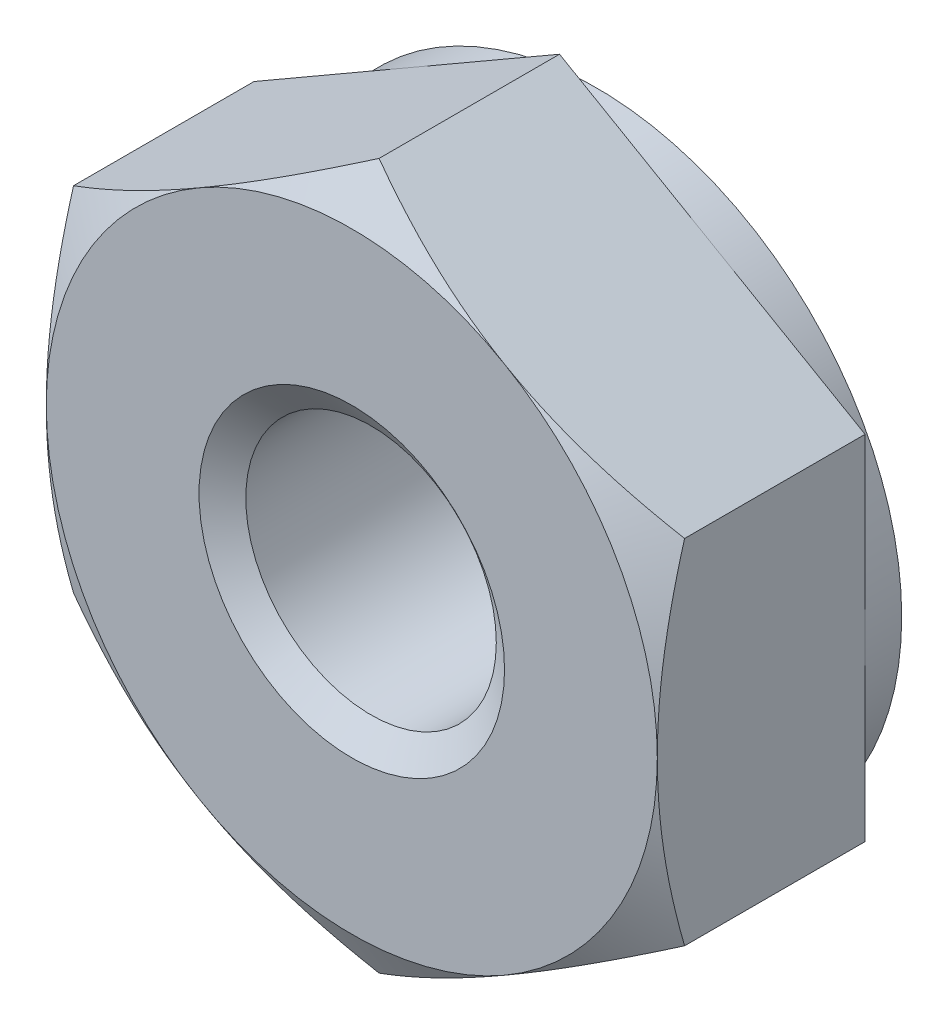
ISO-10303-21;
HEADER;
FILE_DESCRIPTION(('STEP AP214'),'2;1');
FILE_NAME('part.step','',(''),(''),'','','');
FILE_SCHEMA(('AUTOMOTIVE_DESIGN { 1 0 10303 214 1 1 1 1 }'));
ENDSEC;
DATA;
#1=APPLICATION_CONTEXT('core data for automotive mechanical design processes');
#2=APPLICATION_PROTOCOL_DEFINITION('international standard','automotive_design',2000,#1);
#3=PRODUCT_CONTEXT('',#1,'mechanical');
#4=PRODUCT('Part','Part','',(#3));
#5=PRODUCT_RELATED_PRODUCT_CATEGORY('part','',(#4));
#6=PRODUCT_DEFINITION_FORMATION('','',#4);
#7=PRODUCT_DEFINITION_CONTEXT('part definition',#1,'design');
#8=PRODUCT_DEFINITION('design','',#6,#7);
#9=PRODUCT_DEFINITION_SHAPE('','',#8);
#10=(LENGTH_UNIT() NAMED_UNIT(*) SI_UNIT(.MILLI.,.METRE.));
#11=(NAMED_UNIT(*) PLANE_ANGLE_UNIT() SI_UNIT($,.RADIAN.));
#12=(NAMED_UNIT(*) SI_UNIT($,.STERADIAN.) SOLID_ANGLE_UNIT());
#13=UNCERTAINTY_MEASURE_WITH_UNIT(LENGTH_MEASURE(1.E-05),#10,'distance_accuracy_value','');
#14=(GEOMETRIC_REPRESENTATION_CONTEXT(3) GLOBAL_UNCERTAINTY_ASSIGNED_CONTEXT((#13)) GLOBAL_UNIT_ASSIGNED_CONTEXT((#10,
#11,#12)) REPRESENTATION_CONTEXT('',''));
#15=CARTESIAN_POINT('',(0.,0.,0.));
#16=DIRECTION('',(0.,0.,1.));
#17=DIRECTION('',(1.,0.,0.));
#18=AXIS2_PLACEMENT_3D('',#15,#16,#17);
#19=CARTESIAN_POINT('',(0.,0.,-2.));
#20=DIRECTION('',(0.,0.,1.));
#21=DIRECTION('',(1.,0.,0.));
#22=AXIS2_PLACEMENT_3D('',#19,#20,#21);
#23=CYLINDRICAL_SURFACE('',#22,1.025);
#24=CARTESIAN_POINT('',(0.,0.,-0.157546696097185));
#25=DIRECTION('',(0.,0.,1.));
#26=DIRECTION('',(1.,0.,0.));
#27=AXIS2_PLACEMENT_3D('',#24,#25,#26);
#28=CIRCLE('',#27,1.025);
#29=CARTESIAN_POINT('',(1.025,0.,-0.157546696097185));
#30=VERTEX_POINT('',#29);
#31=EDGE_CURVE('E154',#30,#30,#28,.F.);
#32=ORIENTED_EDGE('',*,*,#31,.F.);
#33=EDGE_LOOP('',(#32));
#34=FACE_BOUND('',#33,.T.);
#35=CARTESIAN_POINT('',(0.,0.,-1.81705330390282));
#36=DIRECTION('',(0.,0.,-1.));
#37=DIRECTION('',(-1.,0.,0.));
#38=AXIS2_PLACEMENT_3D('',#35,#36,#37);
#39=CIRCLE('',#38,1.025);
#40=CARTESIAN_POINT('',(-1.025,0.,-1.81705330390282));
#41=VERTEX_POINT('',#40);
#42=EDGE_CURVE('E42',#41,#41,#39,.F.);
#43=ORIENTED_EDGE('',*,*,#42,.F.);
#44=EDGE_LOOP('',(#43));
#45=FACE_BOUND('',#44,.T.);
#46=ADVANCED_FACE('F37',(#34,#45),#23,.F.);
#47=CARTESIAN_POINT('',(0.,2.88675134594813,-2.));
#48=DIRECTION('',(0.,0.,-1.));
#49=DIRECTION('',(-1.,0.,0.));
#50=AXIS2_PLACEMENT_3D('',#47,#48,#49);
#51=PLANE('',#50);
#52=CARTESIAN_POINT('',(0.,0.,-2.));
#53=DIRECTION('',(0.,0.,-1.));
#54=DIRECTION('',(-1.,0.,0.));
#55=AXIS2_PLACEMENT_3D('',#52,#53,#54);
#56=CIRCLE('',#55,2.5);
#57=CARTESIAN_POINT('',(-2.5,0.,-2.));
#58=VERTEX_POINT('',#57);
#59=EDGE_CURVE('E281',#58,#58,#56,.F.);
#60=ORIENTED_EDGE('',*,*,#59,.F.);
#61=EDGE_LOOP('',(#60));
#62=FACE_BOUND('',#61,.T.);
#63=CARTESIAN_POINT('',(0.,0.,-2.));
#64=DIRECTION('',(0.,0.,-1.));
#65=DIRECTION('',(-1.,0.,0.));
#66=AXIS2_PLACEMENT_3D('',#63,#64,#65);
#67=CIRCLE('',#66,1.25);
#68=CARTESIAN_POINT('',(-1.25,0.,-2.));
#69=VERTEX_POINT('',#68);
#70=EDGE_CURVE('E301',#69,#69,#67,.F.);
#71=ORIENTED_EDGE('',*,*,#70,.T.);
#72=EDGE_LOOP('',(#71));
#73=FACE_BOUND('',#72,.T.);
#74=ADVANCED_FACE('F233',(#62,#73),#51,.T.);
#75=CARTESIAN_POINT('',(0.,2.88675134594813,0.));
#76=DIRECTION('',(0.,0.,-1.));
#77=DIRECTION('',(-1.,0.,0.));
#78=AXIS2_PLACEMENT_3D('',#75,#76,#77);
#79=PLANE('',#78);
#80=CARTESIAN_POINT('',(0.,0.,0.));
#81=DIRECTION('',(0.,0.,-1.));
#82=DIRECTION('',(-1.,0.,0.));
#83=AXIS2_PLACEMENT_3D('',#80,#81,#82);
#84=CIRCLE('',#83,2.5);
#85=CARTESIAN_POINT('',(-1.25,2.1650635094611,0.));
#86=VERTEX_POINT('',#85);
#87=CARTESIAN_POINT('',(-2.5,0.,0.));
#88=VERTEX_POINT('',#87);
#89=EDGE_CURVE('E49',#86,#88,#84,.F.);
#90=ORIENTED_EDGE('',*,*,#89,.T.);
#91=CARTESIAN_POINT('',(-1.25,-2.1650635094611,0.));
#92=VERTEX_POINT('',#91);
#93=EDGE_CURVE('E12',#88,#92,#84,.F.);
#94=ORIENTED_EDGE('',*,*,#93,.T.);
#95=CARTESIAN_POINT('',(1.25,-2.1650635094611,0.));
#96=VERTEX_POINT('',#95);
#97=EDGE_CURVE('E47',#92,#96,#84,.F.);
#98=ORIENTED_EDGE('',*,*,#97,.T.);
#99=CARTESIAN_POINT('',(2.5,0.,0.));
#100=VERTEX_POINT('',#99);
#101=EDGE_CURVE('E133',#96,#100,#84,.F.);
#102=ORIENTED_EDGE('',*,*,#101,.T.);
#103=CARTESIAN_POINT('',(0.,0.,0.));
#104=DIRECTION('',(0.,0.,1.));
#105=DIRECTION('',(1.,0.,0.));
#106=AXIS2_PLACEMENT_3D('',#103,#104,#105);
#107=CIRCLE('',#106,2.5);
#108=CARTESIAN_POINT('',(1.25,2.1650635094611,0.));
#109=VERTEX_POINT('',#108);
#110=EDGE_CURVE('E145',#100,#109,#107,.T.);
#111=ORIENTED_EDGE('',*,*,#110,.T.);
#112=EDGE_CURVE('E160',#109,#86,#84,.F.);
#113=ORIENTED_EDGE('',*,*,#112,.T.);
#114=EDGE_LOOP('',(#90,#94,#98,#102,#111,#113));
#115=FACE_BOUND('',#114,.T.);
#116=CARTESIAN_POINT('',(0.,0.,0.));
#117=DIRECTION('',(0.,0.,1.));
#118=DIRECTION('',(1.,0.,0.));
#119=AXIS2_PLACEMENT_3D('',#116,#117,#118);
#120=CIRCLE('',#119,1.25);
#121=CARTESIAN_POINT('',(1.25,0.,0.));
#122=VERTEX_POINT('',#121);
#123=EDGE_CURVE('E300',#122,#122,#120,.T.);
#124=ORIENTED_EDGE('',*,*,#123,.F.);
#125=EDGE_LOOP('',(#124));
#126=FACE_BOUND('',#125,.T.);
#127=ADVANCED_FACE('F157',(#115,#126),#79,.F.);
#128=CARTESIAN_POINT('',(0.,2.88675134594813,-2.));
#129=DIRECTION('',(-0.5,0.866025403784438,0.));
#130=DIRECTION('',(-0.866025403784438,-0.5,0.));
#131=AXIS2_PLACEMENT_3D('',#128,#129,#130);
#132=PLANE('',#131);
#133=DIRECTION('',(0.,0.,1.));
#134=VECTOR('',#133,1.);
#135=CARTESIAN_POINT('',(-2.5,1.44337567297406,-2.));
#136=LINE('',#135,#134);
#137=CARTESIAN_POINT('',(-2.5,1.44337567297406,-1.7));
#138=VERTEX_POINT('',#137);
#139=CARTESIAN_POINT('',(-2.5,1.44337567297406,-0.223290993692604));
#140=VERTEX_POINT('',#139);
#141=EDGE_CURVE('E290',#138,#140,#136,.T.);
#142=ORIENTED_EDGE('',*,*,#141,.T.);
#143=CARTESIAN_POINT('',(-2.5002,1.44326020292023,-0.223357664359109));
#144=CARTESIAN_POINT('',(-2.39033676526513,1.50668977106845,-0.186721620107627));
#145=CARTESIAN_POINT('',(-2.27952520010347,1.57066685804385,-0.153402218965057));
#146=CARTESIAN_POINT('',(-2.05598316653395,1.69972891130041,-0.0952422855578582));
#147=CARTESIAN_POINT('',(-1.94324872547161,1.7648161711947,-0.0704223291477385));
#148=CARTESIAN_POINT('',(-1.71917700612473,1.8941840386774,-0.031785651441052));
#149=CARTESIAN_POINT('',(-1.60787420823262,1.95844473900197,-0.0177117961856388));
#150=CARTESIAN_POINT('',(-1.38474477253167,2.08726857876804,-0.000909152352750061));
#151=CARTESIAN_POINT('',(-1.27291894598577,2.15183124982667,0.00183354879637354));
#152=CARTESIAN_POINT('',(-1.06395802444848,2.27247489412634,-0.00386576000805347));
#153=CARTESIAN_POINT('',(-0.966791682442268,2.32857390783979,-0.0109083943818617));
#154=CARTESIAN_POINT('',(-0.773092050288997,2.44040644260542,-0.0332314191249428));
#155=CARTESIAN_POINT('',(-0.676559430340267,2.4961395767184,-0.0485194384402676));
#156=CARTESIAN_POINT('',(-0.482460278259523,2.60820277442169,-0.0867390938444211));
#157=CARTESIAN_POINT('',(-0.384918318217859,2.66451865130903,-0.109832776125518));
#158=CARTESIAN_POINT('',(-0.191289391923914,2.77631036402774,-0.162246656577914));
#159=CARTESIAN_POINT('',(-0.0951999441138235,2.83178763258718,-0.19155453562455));
#160=CARTESIAN_POINT('',(0.000200000000000565,2.88686681600197,-0.22335766435911));
#161=B_SPLINE_CURVE_WITH_KNOTS('',3,(#143,#144,#145,#146,#147,#148,#149,#150,#151,#152,#153,
#154,#155,#156,#157,#158,#159,#160),.UNSPECIFIED.,.F.,.F.,(4,2,2,2,2,2,2,2,4),(0.,
0.396285827362227,0.793524330152052,1.18093086852114,1.56786160134475,1.90479741793733,
2.24204551660463,2.58677531536756,2.93082800105257),.UNSPECIFIED.);
#162=EDGE_CURVE('E61',#140,#86,#161,.T.);
#163=ORIENTED_EDGE('',*,*,#162,.T.);
#164=CARTESIAN_POINT('',(0.,2.88675134594813,-0.223290993692604));
#165=VERTEX_POINT('',#164);
#166=EDGE_CURVE('E169',#86,#165,#161,.T.);
#167=ORIENTED_EDGE('',*,*,#166,.T.);
#168=DIRECTION('',(0.,0.,1.));
#169=VECTOR('',#168,1.);
#170=CARTESIAN_POINT('',(0.,2.88675134594813,-2.));
#171=LINE('',#170,#169);
#172=CARTESIAN_POINT('',(0.,2.88675134594813,-1.7));
#173=VERTEX_POINT('',#172);
#174=EDGE_CURVE('E278',#173,#165,#171,.T.);
#175=ORIENTED_EDGE('',*,*,#174,.F.);
#176=DIRECTION('',(-0.866025403784438,-0.5,0.));
#177=VECTOR('',#176,1.);
#178=CARTESIAN_POINT('',(0.,2.88675134594813,-1.7));
#179=LINE('',#178,#177);
#180=CARTESIAN_POINT('',(-1.25,2.1650635094611,-1.7));
#181=VERTEX_POINT('',#180);
#182=EDGE_CURVE('E266',#173,#181,#179,.T.);
#183=ORIENTED_EDGE('',*,*,#182,.T.);
#184=EDGE_CURVE('E262',#181,#138,#179,.T.);
#185=ORIENTED_EDGE('',*,*,#184,.T.);
#186=EDGE_LOOP('',(#142,#163,#167,#175,#183,#185));
#187=FACE_BOUND('',#186,.T.);
#188=ADVANCED_FACE('F39',(#187),#132,.T.);
#189=CARTESIAN_POINT('',(2.5,1.44337567297406,-2.));
#190=DIRECTION('',(0.500000000000001,0.866025403784438,0.));
#191=DIRECTION('',(-0.866025403784438,0.500000000000001,0.));
#192=AXIS2_PLACEMENT_3D('',#189,#190,#191);
#193=PLANE('',#192);
#194=ORIENTED_EDGE('',*,*,#174,.T.);
#195=CARTESIAN_POINT('',(-0.000199999999999567,2.88686681600197,-0.22335766435911));
#196=CARTESIAN_POINT('',(0.109663234734872,2.82343724785375,-0.186721620107627));
#197=CARTESIAN_POINT('',(0.220474799896526,2.75946016087834,-0.153402218965057));
#198=CARTESIAN_POINT('',(0.44401683346605,2.63039810762178,-0.0952422855578585));
#199=CARTESIAN_POINT('',(0.556751274528389,2.5653108477275,-0.0704223291477389));
#200=CARTESIAN_POINT('',(0.78082299387527,2.43594298024479,-0.0317856514410521));
#201=CARTESIAN_POINT('',(0.892125791767378,2.37168227992023,-0.0177117961856388));
#202=CARTESIAN_POINT('',(1.11525522746834,2.24285844015415,-0.000909152352749881));
#203=CARTESIAN_POINT('',(1.22708105401423,2.17829576909552,0.00183354879637364));
#204=CARTESIAN_POINT('',(1.43604197555152,2.05765212479586,-0.00386576000805331));
#205=CARTESIAN_POINT('',(1.53320831755773,2.0015531110824,-0.0109083943818614));
#206=CARTESIAN_POINT('',(1.726907949711,1.88972057631678,-0.0332314191249423));
#207=CARTESIAN_POINT('',(1.82344056965973,1.8339874422038,-0.0485194384402671));
#208=CARTESIAN_POINT('',(2.01753972174048,1.7219242445005,-0.0867390938444206));
#209=CARTESIAN_POINT('',(2.11508168178214,1.66560836761316,-0.109832776125517));
#210=CARTESIAN_POINT('',(2.30871060807609,1.55381665489446,-0.162246656577914));
#211=CARTESIAN_POINT('',(2.40480005588618,1.49833938633502,-0.191554535624549));
#212=CARTESIAN_POINT('',(2.5002,1.44326020292023,-0.223357664359109));
#213=B_SPLINE_CURVE_WITH_KNOTS('',3,(#195,#196,#197,#198,#199,#200,#201,#202,#203,#204,#205,
#206,#207,#208,#209,#210,#211,#212),.UNSPECIFIED.,.F.,.F.,(4,2,2,2,2,2,2,2,4),(0.,
0.396285827362228,0.793524330152052,1.18093086852114,1.56786160134476,1.90479741793733,
2.24204551660463,2.58677531536756,2.93082800105257),.UNSPECIFIED.);
#214=EDGE_CURVE('E166',#165,#109,#213,.T.);
#215=ORIENTED_EDGE('',*,*,#214,.T.);
#216=CARTESIAN_POINT('',(2.5,1.44337567297407,-0.223290993692604));
#217=VERTEX_POINT('',#216);
#218=EDGE_CURVE('E148',#109,#217,#213,.T.);
#219=ORIENTED_EDGE('',*,*,#218,.T.);
#220=DIRECTION('',(0.,0.,1.));
#221=VECTOR('',#220,1.);
#222=CARTESIAN_POINT('',(2.5,1.44337567297406,-2.));
#223=LINE('',#222,#221);
#224=CARTESIAN_POINT('',(2.5,1.44337567297406,-1.7));
#225=VERTEX_POINT('',#224);
#226=EDGE_CURVE('E165',#225,#217,#223,.T.);
#227=ORIENTED_EDGE('',*,*,#226,.F.);
#228=DIRECTION('',(-0.866025403784438,0.500000000000001,0.));
#229=VECTOR('',#228,1.);
#230=CARTESIAN_POINT('',(2.5,1.44337567297406,-1.7));
#231=LINE('',#230,#229);
#232=CARTESIAN_POINT('',(1.25,2.1650635094611,-1.7));
#233=VERTEX_POINT('',#232);
#234=EDGE_CURVE('E274',#225,#233,#231,.T.);
#235=ORIENTED_EDGE('',*,*,#234,.T.);
#236=EDGE_CURVE('E270',#233,#173,#231,.T.);
#237=ORIENTED_EDGE('',*,*,#236,.T.);
#238=EDGE_LOOP('',(#194,#215,#219,#227,#235,#237));
#239=FACE_BOUND('',#238,.T.);
#240=ADVANCED_FACE('F246',(#239),#193,.T.);
#241=CARTESIAN_POINT('',(2.5,1.44337567297406,-2.));
#242=DIRECTION('',(-1.,0.,0.));
#243=DIRECTION('',(0.,0.,1.));
#244=AXIS2_PLACEMENT_3D('',#241,#242,#243);
#245=PLANE('',#244);
#246=CARTESIAN_POINT('',(2.5,-3.82804499372432,-1.1963167632754));
#247=CARTESIAN_POINT('',(2.5,-3.71828085649173,-1.14327266922931));
#248=CARTESIAN_POINT('',(2.5,-3.60825720059554,-1.09075587737963));
#249=CARTESIAN_POINT('',(2.5,-3.38755052986221,-0.987078216748228));
#250=CARTESIAN_POINT('',(2.5,-3.27686740487455,-0.935917582729521));
#251=CARTESIAN_POINT('',(2.5,-3.05410357303959,-0.834984039411599));
#252=CARTESIAN_POINT('',(2.5,-2.94201849305851,-0.7852207469144));
#253=CARTESIAN_POINT('',(2.5,-2.71692709217039,-0.687831615887687));
#254=CARTESIAN_POINT('',(2.5,-2.60392081964711,-0.640205665942513));
#255=CARTESIAN_POINT('',(2.5,-2.37540441715611,-0.547094156496477));
#256=CARTESIAN_POINT('',(2.5,-2.25988058014231,-0.501642052634904));
#257=CARTESIAN_POINT('',(2.5,-2.02747029246855,-0.414297644349638));
#258=CARTESIAN_POINT('',(2.5,-1.91058369184876,-0.372405735979065));
#259=CARTESIAN_POINT('',(2.5,-1.67550198908606,-0.293307342769301));
#260=CARTESIAN_POINT('',(2.5,-1.5573102732053,-0.256090896739898));
#261=CARTESIAN_POINT('',(2.5,-1.31924659147407,-0.187552097840316));
#262=CARTESIAN_POINT('',(2.5,-1.19937516991093,-0.15622788104797));
#263=CARTESIAN_POINT('',(2.5,-0.957870204363749,-0.100994246846276));
#264=CARTESIAN_POINT('',(2.5,-0.836236200197809,-0.0770868037228373));
#265=CARTESIAN_POINT('',(2.5,-0.591501703670345,-0.0382963974514643));
#266=CARTESIAN_POINT('',(2.5,-0.468401210012358,-0.0234134422823115));
#267=CARTESIAN_POINT('',(2.5,-0.222157493517463,-0.00398863321839737));
#268=CARTESIAN_POINT('',(2.5,-0.0990195694337562,0.000618687975651133));
#269=CARTESIAN_POINT('',(2.5,0.147170053504669,-0.000752541484247088));
#270=CARTESIAN_POINT('',(2.5,0.270221766445129,-0.00672834425959414));
#271=CARTESIAN_POINT('',(2.5,0.480350397015949,-0.0255492091334943));
#272=CARTESIAN_POINT('',(2.5,0.567659136488638,-0.0359433100274438));
#273=CARTESIAN_POINT('',(2.5,0.741602181646859,-0.0613833814666827));
#274=CARTESIAN_POINT('',(2.5,0.828236378756333,-0.0764300856615295));
#275=CARTESIAN_POINT('',(2.5,1.08705653408106,-0.127759419343895));
#276=CARTESIAN_POINT('',(2.5,1.25802931580451,-0.170218054015721));
#277=CARTESIAN_POINT('',(2.5,1.51386408134077,-0.243447724573253));
#278=CARTESIAN_POINT('',(2.5,1.60005960225962,-0.269821213632274));
#279=CARTESIAN_POINT('',(2.5,1.77155099438377,-0.325177862642353));
#280=CARTESIAN_POINT('',(2.5,1.85684744139723,-0.354159222616821));
#281=CARTESIAN_POINT('',(2.5,2.02618400322713,-0.41412856198768));
#282=CARTESIAN_POINT('',(2.5,2.11022848716774,-0.445104328595939));
#283=CARTESIAN_POINT('',(2.5,2.27766538220571,-0.50887397111919));
#284=CARTESIAN_POINT('',(2.5,2.36105751399617,-0.541668581852107));
#285=CARTESIAN_POINT('',(2.5,2.44414811866678,-0.575193129088622));
#286=B_SPLINE_CURVE_WITH_KNOTS('',3,(#246,#247,#248,#249,#250,#251,#252,#253,#254,#255,#256,
#257,#258,#259,#260,#261,#262,#263,#264,#265,#266,#267,#268,#269,#270,#271,#272,#273,#274,#275,
#276,#277,#278,#279,#280,#281,#282,#283,#284,#285),.UNSPECIFIED.,.F.,.F.,(4,2,2,2,2,2,2,2,2,2,2,
2,2,2,2,2,2,2,2,4),(0.,0.36573237033267,0.731527644124543,1.09941621653744,1.46728558928017,
1.83967125623427,2.21209829506681,2.58371790436,2.95521975869669,3.32682041917403,
3.69842140819258,4.06764803658773,4.43677881037429,4.70042588015951,4.96411454456775,
5.49188432099894,5.76228301186056,6.03249648197686,6.30118900914356,6.56999089095293),.UNSPECIFIED.);
#287=CARTESIAN_POINT('',(2.5,-1.44337567297406,-0.223290993692604));
#288=VERTEX_POINT('',#287);
#289=EDGE_CURVE('E129',#288,#100,#286,.T.);
#290=ORIENTED_EDGE('',*,*,#289,.F.);
#291=DIRECTION('',(0.,0.,1.));
#292=VECTOR('',#291,1.);
#293=CARTESIAN_POINT('',(2.5,-1.44337567297407,-2.));
#294=LINE('',#293,#292);
#295=CARTESIAN_POINT('',(2.5,-1.44337567297407,-1.7));
#296=VERTEX_POINT('',#295);
#297=EDGE_CURVE('E283',#296,#288,#294,.T.);
#298=ORIENTED_EDGE('',*,*,#297,.F.);
#299=DIRECTION('',(0.,-1.,0.));
#300=VECTOR('',#299,1.);
#301=CARTESIAN_POINT('',(2.5,1.44337567297406,-1.7));
#302=LINE('',#301,#300);
#303=CARTESIAN_POINT('',(2.5,0.,-1.7));
#304=VERTEX_POINT('',#303);
#305=EDGE_CURVE('E275',#304,#296,#302,.T.);
#306=ORIENTED_EDGE('',*,*,#305,.F.);
#307=EDGE_CURVE('E277',#225,#304,#302,.T.);
#308=ORIENTED_EDGE('',*,*,#307,.F.);
#309=ORIENTED_EDGE('',*,*,#226,.T.);
#310=EDGE_CURVE('E142',#100,#217,#286,.T.);
#311=ORIENTED_EDGE('',*,*,#310,.F.);
#312=EDGE_LOOP('',(#290,#298,#306,#308,#309,#311));
#313=FACE_BOUND('',#312,.T.);
#314=ADVANCED_FACE('F162',(#313),#245,.F.);
#315=CARTESIAN_POINT('',(0.,-2.88675134594813,-2.));
#316=DIRECTION('',(0.5,-0.866025403784439,0.));
#317=DIRECTION('',(0.866025403784438,0.5,0.));
#318=AXIS2_PLACEMENT_3D('',#315,#316,#317);
#319=PLANE('',#318);
#320=ORIENTED_EDGE('',*,*,#297,.T.);
#321=CARTESIAN_POINT('',(2.5002,-1.44326020292023,-0.22335766435911));
#322=CARTESIAN_POINT('',(2.39033676526513,-1.50668977106845,-0.186721620107627));
#323=CARTESIAN_POINT('',(2.27952520010347,-1.57066685804385,-0.153402218965057));
#324=CARTESIAN_POINT('',(2.05598316653395,-1.69972891130042,-0.0952422855578586));
#325=CARTESIAN_POINT('',(1.94324872547161,-1.7648161711947,-0.070422329147739));
#326=CARTESIAN_POINT('',(1.71917700612473,-1.8941840386774,-0.0317856514410526));
#327=CARTESIAN_POINT('',(1.60787420823262,-1.95844473900197,-0.0177117961856395));
#328=CARTESIAN_POINT('',(1.38474477253167,-2.08726857876805,-0.000909152352750779));
#329=CARTESIAN_POINT('',(1.27291894598577,-2.15183124982667,0.00183354879637279));
#330=CARTESIAN_POINT('',(1.06395802444848,-2.27247489412634,-0.00386576000805421));
#331=CARTESIAN_POINT('',(0.966791682442268,-2.3285739078398,-0.0109083943818624));
#332=CARTESIAN_POINT('',(0.773092050288996,-2.44040644260542,-0.0332314191249434));
#333=CARTESIAN_POINT('',(0.676559430340267,-2.4961395767184,-0.0485194384402682));
#334=CARTESIAN_POINT('',(0.482460278259523,-2.60820277442169,-0.0867390938444218));
#335=CARTESIAN_POINT('',(0.384918318217859,-2.66451865130903,-0.109832776125519));
#336=CARTESIAN_POINT('',(0.191289391923915,-2.77631036402774,-0.162246656577915));
#337=CARTESIAN_POINT('',(0.0951999441138239,-2.83178763258718,-0.191554535624551));
#338=CARTESIAN_POINT('',(-0.000200000000000038,-2.88686681600197,-0.223357664359111));
#339=B_SPLINE_CURVE_WITH_KNOTS('',3,(#321,#322,#323,#324,#325,#326,#327,#328,#329,#330,#331,
#332,#333,#334,#335,#336,#337,#338),.UNSPECIFIED.,.F.,.F.,(4,2,2,2,2,2,2,2,4),(0.,
0.396285827362227,0.793524330152052,1.18093086852114,1.56786160134476,1.90479741793733,
2.24204551660463,2.58677531536756,2.93082800105257),.UNSPECIFIED.);
#340=EDGE_CURVE('E136',#288,#96,#339,.T.);
#341=ORIENTED_EDGE('',*,*,#340,.T.);
#342=CARTESIAN_POINT('',(0.,-2.88675134594813,-0.223290993692604));
#343=VERTEX_POINT('',#342);
#344=EDGE_CURVE('E176',#96,#343,#339,.T.);
#345=ORIENTED_EDGE('',*,*,#344,.T.);
#346=DIRECTION('',(0.,0.,1.));
#347=VECTOR('',#346,1.);
#348=CARTESIAN_POINT('',(0.,-2.88675134594813,-2.));
#349=LINE('',#348,#347);
#350=CARTESIAN_POINT('',(0.,-2.88675134594813,-1.7));
#351=VERTEX_POINT('',#350);
#352=EDGE_CURVE('E285',#351,#343,#349,.T.);
#353=ORIENTED_EDGE('',*,*,#352,.F.);
#354=DIRECTION('',(0.866025403784438,0.5,0.));
#355=VECTOR('',#354,1.);
#356=CARTESIAN_POINT('',(0.,-2.88675134594813,-1.7));
#357=LINE('',#356,#355);
#358=CARTESIAN_POINT('',(1.25,-2.1650635094611,-1.7));
#359=VERTEX_POINT('',#358);
#360=EDGE_CURVE('E267',#351,#359,#357,.T.);
#361=ORIENTED_EDGE('',*,*,#360,.T.);
#362=EDGE_CURVE('E271',#359,#296,#357,.T.);
#363=ORIENTED_EDGE('',*,*,#362,.T.);
#364=EDGE_LOOP('',(#320,#341,#345,#353,#361,#363));
#365=FACE_BOUND('',#364,.T.);
#366=ADVANCED_FACE('F219',(#365),#319,.T.);
#367=CARTESIAN_POINT('',(-2.5,-1.44337567297407,-2.));
#368=DIRECTION('',(-0.500000000000001,-0.866025403784438,0.));
#369=DIRECTION('',(0.866025403784438,-0.500000000000001,0.));
#370=AXIS2_PLACEMENT_3D('',#367,#368,#369);
#371=PLANE('',#370);
#372=ORIENTED_EDGE('',*,*,#352,.T.);
#373=CARTESIAN_POINT('',(0.00019999999999975,-2.88686681600197,-0.223357664359111));
#374=CARTESIAN_POINT('',(-0.109663234734872,-2.82343724785375,-0.186721620107628));
#375=CARTESIAN_POINT('',(-0.220474799896526,-2.75946016087834,-0.153402218965058));
#376=CARTESIAN_POINT('',(-0.444016833466051,-2.63039810762178,-0.095242285557859));
#377=CARTESIAN_POINT('',(-0.556751274528389,-2.5653108477275,-0.0704223291477394));
#378=CARTESIAN_POINT('',(-0.78082299387527,-2.43594298024479,-0.0317856514410527));
#379=CARTESIAN_POINT('',(-0.892125791767378,-2.37168227992023,-0.0177117961856395));
#380=CARTESIAN_POINT('',(-1.11525522746834,-2.24285844015415,-0.00090915235275052));
#381=CARTESIAN_POINT('',(-1.22708105401423,-2.17829576909553,0.00183354879637318));
#382=CARTESIAN_POINT('',(-1.43604197555152,-2.05765212479586,-0.00386576000805385));
#383=CARTESIAN_POINT('',(-1.53320831755773,-2.0015531110824,-0.0109083943818621));
#384=CARTESIAN_POINT('',(-1.726907949711,-1.88972057631678,-0.0332314191249431));
#385=CARTESIAN_POINT('',(-1.82344056965973,-1.8339874422038,-0.0485194384402676));
#386=CARTESIAN_POINT('',(-2.01753972174048,-1.7219242445005,-0.086739093844421));
#387=CARTESIAN_POINT('',(-2.11508168178214,-1.66560836761316,-0.109832776125518));
#388=CARTESIAN_POINT('',(-2.30871060807609,-1.55381665489446,-0.162246656577914));
#389=CARTESIAN_POINT('',(-2.40480005588618,-1.49833938633502,-0.19155453562455));
#390=CARTESIAN_POINT('',(-2.5002,-1.44326020292023,-0.223357664359109));
#391=B_SPLINE_CURVE_WITH_KNOTS('',3,(#373,#374,#375,#376,#377,#378,#379,#380,#381,#382,#383,
#384,#385,#386,#387,#388,#389,#390),.UNSPECIFIED.,.F.,.F.,(4,2,2,2,2,2,2,2,4),(0.,
0.396285827362228,0.793524330152052,1.18093086852114,1.56786160134476,1.90479741793733,
2.24204551660463,2.58677531536756,2.93082800105257),.UNSPECIFIED.);
#392=EDGE_CURVE('E213',#343,#92,#391,.T.);
#393=ORIENTED_EDGE('',*,*,#392,.T.);
#394=CARTESIAN_POINT('',(-2.5,-1.44337567297407,-0.223290993692604));
#395=VERTEX_POINT('',#394);
#396=EDGE_CURVE('E206',#92,#395,#391,.T.);
#397=ORIENTED_EDGE('',*,*,#396,.T.);
#398=DIRECTION('',(0.,0.,1.));
#399=VECTOR('',#398,1.);
#400=CARTESIAN_POINT('',(-2.5,-1.44337567297407,-2.));
#401=LINE('',#400,#399);
#402=CARTESIAN_POINT('',(-2.5,-1.44337567297407,-1.7));
#403=VERTEX_POINT('',#402);
#404=EDGE_CURVE('E288',#403,#395,#401,.T.);
#405=ORIENTED_EDGE('',*,*,#404,.F.);
#406=DIRECTION('',(0.866025403784438,-0.500000000000001,0.));
#407=VECTOR('',#406,1.);
#408=CARTESIAN_POINT('',(-2.5,-1.44337567297407,-1.7));
#409=LINE('',#408,#407);
#410=CARTESIAN_POINT('',(-1.25,-2.1650635094611,-1.7));
#411=VERTEX_POINT('',#410);
#412=EDGE_CURVE('E257',#403,#411,#409,.T.);
#413=ORIENTED_EDGE('',*,*,#412,.T.);
#414=EDGE_CURVE('E263',#411,#351,#409,.T.);
#415=ORIENTED_EDGE('',*,*,#414,.T.);
#416=EDGE_LOOP('',(#372,#393,#397,#405,#413,#415));
#417=FACE_BOUND('',#416,.T.);
#418=ADVANCED_FACE('F215',(#417),#371,.T.);
#419=CARTESIAN_POINT('',(-2.5,1.44337567297406,-2.));
#420=DIRECTION('',(-1.,0.,0.));
#421=DIRECTION('',(0.,0.,1.));
#422=AXIS2_PLACEMENT_3D('',#419,#420,#421);
#423=PLANE('',#422);
#424=ORIENTED_EDGE('',*,*,#404,.T.);
#425=CARTESIAN_POINT('',(-2.5,-3.82804499372432,-1.1963167632754));
#426=CARTESIAN_POINT('',(-2.5,-3.71828085649172,-1.14327266922931));
#427=CARTESIAN_POINT('',(-2.5,-3.60825720059554,-1.09075587737963));
#428=CARTESIAN_POINT('',(-2.5,-3.38755052986221,-0.987078216748228));
#429=CARTESIAN_POINT('',(-2.5,-3.27686740487455,-0.93591758272952));
#430=CARTESIAN_POINT('',(-2.5,-3.05410357303959,-0.834984039411598));
#431=CARTESIAN_POINT('',(-2.5,-2.94201849305851,-0.785220746914399));
#432=CARTESIAN_POINT('',(-2.5,-2.71692709217039,-0.687831615887686));
#433=CARTESIAN_POINT('',(-2.5,-2.60392081964711,-0.640205665942513));
#434=CARTESIAN_POINT('',(-2.5,-2.37540441715611,-0.547094156496477));
#435=CARTESIAN_POINT('',(-2.5,-2.25988058014231,-0.501642052634903));
#436=CARTESIAN_POINT('',(-2.5,-2.02747029246855,-0.414297644349637));
#437=CARTESIAN_POINT('',(-2.5,-1.91058369184876,-0.372405735979065));
#438=CARTESIAN_POINT('',(-2.5,-1.67550198908606,-0.293307342769301));
#439=CARTESIAN_POINT('',(-2.5,-1.5573102732053,-0.256090896739898));
#440=CARTESIAN_POINT('',(-2.5,-1.31924659147407,-0.187552097840316));
#441=CARTESIAN_POINT('',(-2.5,-1.19937516991093,-0.15622788104797));
#442=CARTESIAN_POINT('',(-2.5,-0.957870204363748,-0.100994246846276));
#443=CARTESIAN_POINT('',(-2.5,-0.836236200197809,-0.077086803722837));
#444=CARTESIAN_POINT('',(-2.5,-0.591501703670344,-0.0382963974514641));
#445=CARTESIAN_POINT('',(-2.5,-0.468401210012357,-0.0234134422823114));
#446=CARTESIAN_POINT('',(-2.5,-0.222157493517462,-0.00398863321839741));
#447=CARTESIAN_POINT('',(-2.5,-0.0990195694337551,0.000618687975651116));
#448=CARTESIAN_POINT('',(-2.5,0.14717005350467,-0.000752541484247069));
#449=CARTESIAN_POINT('',(-2.5,0.27022176644513,-0.00672834425959408));
#450=CARTESIAN_POINT('',(-2.5,0.480350397015949,-0.0255492091334943));
#451=CARTESIAN_POINT('',(-2.5,0.567659136488638,-0.0359433100274439));
#452=CARTESIAN_POINT('',(-2.5,0.741602181646859,-0.0613833814666827));
#453=CARTESIAN_POINT('',(-2.5,0.828236378756333,-0.0764300856615292));
#454=CARTESIAN_POINT('',(-2.5,1.08705653408106,-0.127759419343895));
#455=CARTESIAN_POINT('',(-2.5,1.25802931580451,-0.170218054015722));
#456=CARTESIAN_POINT('',(-2.5,1.51386408134077,-0.243447724573253));
#457=CARTESIAN_POINT('',(-2.5,1.60005960225962,-0.269821213632274));
#458=CARTESIAN_POINT('',(-2.5,1.77155099438377,-0.325177862642352));
#459=CARTESIAN_POINT('',(-2.5,1.85684744139723,-0.354159222616822));
#460=CARTESIAN_POINT('',(-2.5,2.02618400322713,-0.414128561987681));
#461=CARTESIAN_POINT('',(-2.5,2.11022848716774,-0.445104328595939));
#462=CARTESIAN_POINT('',(-2.5,2.27766538220571,-0.508873971119191));
#463=CARTESIAN_POINT('',(-2.5,2.36105751399617,-0.541668581852108));
#464=CARTESIAN_POINT('',(-2.5,2.44414811866678,-0.575193129088622));
#465=B_SPLINE_CURVE_WITH_KNOTS('',3,(#425,#426,#427,#428,#429,#430,#431,#432,#433,#434,#435,
#436,#437,#438,#439,#440,#441,#442,#443,#444,#445,#446,#447,#448,#449,#450,#451,#452,#453,#454,
#455,#456,#457,#458,#459,#460,#461,#462,#463,#464),.UNSPECIFIED.,.F.,.F.,(4,2,2,2,2,2,2,2,2,2,2,
2,2,2,2,2,2,2,2,4),(0.,0.365732370332669,0.731527644124542,1.09941621653743,1.46728558928017,
1.83967125623427,2.21209829506681,2.58371790436,2.95521975869669,3.32682041917403,
3.69842140819258,4.06764803658773,4.43677881037429,4.70042588015951,4.96411454456775,
5.49188432099893,5.76228301186056,6.03249648197686,6.30118900914356,6.56999089095293),.UNSPECIFIED.);
#466=EDGE_CURVE('E214',#395,#88,#465,.T.);
#467=ORIENTED_EDGE('',*,*,#466,.T.);
#468=EDGE_CURVE('E153',#88,#140,#465,.T.);
#469=ORIENTED_EDGE('',*,*,#468,.T.);
#470=ORIENTED_EDGE('',*,*,#141,.F.);
#471=DIRECTION('',(0.,-1.,0.));
#472=VECTOR('',#471,1.);
#473=CARTESIAN_POINT('',(-2.5,1.44337567297406,-1.7));
#474=LINE('',#473,#472);
#475=CARTESIAN_POINT('',(-2.5,0.,-1.7));
#476=VERTEX_POINT('',#475);
#477=EDGE_CURVE('E297',#138,#476,#474,.T.);
#478=ORIENTED_EDGE('',*,*,#477,.T.);
#479=EDGE_CURVE('E295',#476,#403,#474,.T.);
#480=ORIENTED_EDGE('',*,*,#479,.T.);
#481=EDGE_LOOP('',(#424,#467,#469,#470,#478,#480));
#482=FACE_BOUND('',#481,.T.);
#483=ADVANCED_FACE('F218',(#482),#423,.T.);
#484=CARTESIAN_POINT('',(0.,12.8867513459481,-1.7));
#485=DIRECTION('',(0.,0.,-1.));
#486=DIRECTION('',(-1.,0.,0.));
#487=AXIS2_PLACEMENT_3D('',#484,#485,#486);
#488=PLANE('',#487);
#489=ORIENTED_EDGE('',*,*,#307,.T.);
#490=CARTESIAN_POINT('',(0.,0.,-1.7));
#491=DIRECTION('',(0.,0.,1.));
#492=DIRECTION('',(1.,0.,0.));
#493=AXIS2_PLACEMENT_3D('',#490,#491,#492);
#494=CIRCLE('',#493,2.5);
#495=EDGE_CURVE('E254',#304,#233,#494,.T.);
#496=ORIENTED_EDGE('',*,*,#495,.T.);
#497=ORIENTED_EDGE('',*,*,#234,.F.);
#498=EDGE_LOOP('',(#489,#496,#497));
#499=FACE_BOUND('',#498,.T.);
#500=ADVANCED_FACE('F224',(#499),#488,.T.);
#501=ORIENTED_EDGE('',*,*,#305,.T.);
#502=ORIENTED_EDGE('',*,*,#362,.F.);
#503=EDGE_CURVE('E259',#359,#304,#494,.T.);
#504=ORIENTED_EDGE('',*,*,#503,.T.);
#505=EDGE_LOOP('',(#501,#502,#504));
#506=FACE_BOUND('',#505,.T.);
#507=ADVANCED_FACE('F229',(#506),#488,.T.);
#508=EDGE_CURVE('E258',#233,#181,#494,.T.);
#509=ORIENTED_EDGE('',*,*,#508,.T.);
#510=ORIENTED_EDGE('',*,*,#182,.F.);
#511=ORIENTED_EDGE('',*,*,#236,.F.);
#512=EDGE_LOOP('',(#509,#510,#511));
#513=FACE_BOUND('',#512,.T.);
#514=ADVANCED_FACE('F438',(#513),#488,.T.);
#515=ORIENTED_EDGE('',*,*,#414,.F.);
#516=EDGE_CURVE('E510',#411,#359,#494,.T.);
#517=ORIENTED_EDGE('',*,*,#516,.T.);
#518=ORIENTED_EDGE('',*,*,#360,.F.);
#519=EDGE_LOOP('',(#515,#517,#518));
#520=FACE_BOUND('',#519,.T.);
#521=ADVANCED_FACE('F429',(#520),#488,.T.);
#522=EDGE_CURVE('E527',#181,#476,#494,.T.);
#523=ORIENTED_EDGE('',*,*,#522,.T.);
#524=ORIENTED_EDGE('',*,*,#477,.F.);
#525=ORIENTED_EDGE('',*,*,#184,.F.);
#526=EDGE_LOOP('',(#523,#524,#525));
#527=FACE_BOUND('',#526,.T.);
#528=ADVANCED_FACE('F413',(#527),#488,.T.);
#529=CARTESIAN_POINT('',(0.,0.,0.));
#530=DIRECTION('',(0.,0.,1.));
#531=DIRECTION('',(1.,0.,0.));
#532=AXIS2_PLACEMENT_3D('',#529,#530,#531);
#533=CYLINDRICAL_SURFACE('',#532,2.5);
#534=ORIENTED_EDGE('',*,*,#59,.T.);
#535=EDGE_LOOP('',(#534));
#536=FACE_BOUND('',#535,.T.);
#537=ORIENTED_EDGE('',*,*,#508,.F.);
#538=ORIENTED_EDGE('',*,*,#495,.F.);
#539=ORIENTED_EDGE('',*,*,#503,.F.);
#540=ORIENTED_EDGE('',*,*,#516,.F.);
#541=EDGE_CURVE('E522',#476,#411,#494,.T.);
#542=ORIENTED_EDGE('',*,*,#541,.F.);
#543=ORIENTED_EDGE('',*,*,#522,.F.);
#544=EDGE_LOOP('',(#537,#538,#539,#540,#542,#543));
#545=FACE_BOUND('',#544,.T.);
#546=ADVANCED_FACE('F243',(#536,#545),#533,.T.);
#547=ORIENTED_EDGE('',*,*,#479,.F.);
#548=ORIENTED_EDGE('',*,*,#541,.T.);
#549=ORIENTED_EDGE('',*,*,#412,.F.);
#550=EDGE_LOOP('',(#547,#548,#549));
#551=FACE_BOUND('',#550,.T.);
#552=ADVANCED_FACE('F196',(#551),#488,.T.);
#553=CARTESIAN_POINT('',(0.,0.,0.));
#554=DIRECTION('',(0.,0.,-1.));
#555=DIRECTION('',(-1.,0.,0.));
#556=AXIS2_PLACEMENT_3D('',#553,#554,#555);
#557=CONICAL_SURFACE('',#556,2.5,1.0471975511966);
#558=ORIENTED_EDGE('',*,*,#468,.F.);
#559=ORIENTED_EDGE('',*,*,#89,.F.);
#560=ORIENTED_EDGE('',*,*,#162,.F.);
#561=EDGE_LOOP('',(#558,#559,#560));
#562=FACE_BOUND('',#561,.T.);
#563=ADVANCED_FACE('F375',(#562),#557,.T.);
#564=ORIENTED_EDGE('',*,*,#112,.F.);
#565=ORIENTED_EDGE('',*,*,#214,.F.);
#566=ORIENTED_EDGE('',*,*,#166,.F.);
#567=EDGE_LOOP('',(#564,#565,#566));
#568=FACE_BOUND('',#567,.T.);
#569=ADVANCED_FACE('F194',(#568),#557,.T.);
#570=ORIENTED_EDGE('',*,*,#110,.F.);
#571=ORIENTED_EDGE('',*,*,#310,.T.);
#572=ORIENTED_EDGE('',*,*,#218,.F.);
#573=EDGE_LOOP('',(#570,#571,#572));
#574=FACE_BOUND('',#573,.T.);
#575=ADVANCED_FACE('F146',(#574),#557,.T.);
#576=ORIENTED_EDGE('',*,*,#289,.T.);
#577=ORIENTED_EDGE('',*,*,#101,.F.);
#578=ORIENTED_EDGE('',*,*,#340,.F.);
#579=EDGE_LOOP('',(#576,#577,#578));
#580=FACE_BOUND('',#579,.T.);
#581=ADVANCED_FACE('F131',(#580),#557,.T.);
#582=ORIENTED_EDGE('',*,*,#97,.F.);
#583=ORIENTED_EDGE('',*,*,#392,.F.);
#584=ORIENTED_EDGE('',*,*,#344,.F.);
#585=EDGE_LOOP('',(#582,#583,#584));
#586=FACE_BOUND('',#585,.T.);
#587=ADVANCED_FACE('F193',(#586),#557,.T.);
#588=ORIENTED_EDGE('',*,*,#93,.F.);
#589=ORIENTED_EDGE('',*,*,#466,.F.);
#590=ORIENTED_EDGE('',*,*,#396,.F.);
#591=EDGE_LOOP('',(#588,#589,#590));
#592=FACE_BOUND('',#591,.T.);
#593=ADVANCED_FACE('F187',(#592),#557,.T.);
#594=CARTESIAN_POINT('',(0.,0.,-0.173301365706903));
#595=DIRECTION('',(0.,0.,1.));
#596=DIRECTION('',(1.,0.,0.));
#597=AXIS2_PLACEMENT_3D('',#594,#595,#596);
#598=CONICAL_SURFACE('',#597,1.0025,0.959931088596882);
#599=ORIENTED_EDGE('',*,*,#123,.T.);
#600=EDGE_LOOP('',(#599));
#601=FACE_BOUND('',#600,.T.);
#602=ORIENTED_EDGE('',*,*,#31,.T.);
#603=EDGE_LOOP('',(#602));
#604=FACE_BOUND('',#603,.T.);
#605=ADVANCED_FACE('F192',(#601,#604),#598,.F.);
#606=CARTESIAN_POINT('',(0.,0.,-1.9746));
#607=DIRECTION('',(0.,0.,-1.));
#608=DIRECTION('',(-1.,0.,0.));
#609=AXIS2_PLACEMENT_3D('',#606,#607,#608);
#610=CONICAL_SURFACE('',#609,1.25,0.959931088596882);
#611=CARTESIAN_POINT('',(0.,0.,-1.9746));
#612=DIRECTION('',(0.,0.,1.));
#613=DIRECTION('',(1.,0.,0.));
#614=AXIS2_PLACEMENT_3D('',#611,#612,#613);
#615=CIRCLE('',#614,1.25);
#616=CARTESIAN_POINT('',(1.25,0.,-1.9746));
#617=VERTEX_POINT('',#616);
#618=EDGE_CURVE('E303',#617,#617,#615,.T.);
#619=ORIENTED_EDGE('',*,*,#618,.F.);
#620=EDGE_LOOP('',(#619));
#621=FACE_BOUND('',#620,.T.);
#622=ORIENTED_EDGE('',*,*,#42,.T.);
#623=EDGE_LOOP('',(#622));
#624=FACE_BOUND('',#623,.T.);
#625=ADVANCED_FACE('F317',(#621,#624),#610,.F.);
#626=CARTESIAN_POINT('',(0.,0.,-25.0375057290932));
#627=DIRECTION('',(0.,0.,1.));
#628=DIRECTION('',(1.,0.,0.));
#629=AXIS2_PLACEMENT_3D('',#626,#627,#628);
#630=CYLINDRICAL_SURFACE('',#629,1.25);
#631=ORIENTED_EDGE('',*,*,#70,.F.);
#632=EDGE_LOOP('',(#631));
#633=FACE_BOUND('',#632,.T.);
#634=ORIENTED_EDGE('',*,*,#618,.T.);
#635=EDGE_LOOP('',(#634));
#636=FACE_BOUND('',#635,.T.);
#637=ADVANCED_FACE('F321',(#633,#636),#630,.F.);
#638=CLOSED_SHELL('',(#46,#74,#127,#188,#240,#314,#366,#418,#483,#500,#507,#514,#521,#528,#546,
#552,#563,#569,#575,#581,#587,#593,#605,#625,#637));
#639=MANIFOLD_SOLID_BREP('B2',#638);
#640=ADVANCED_BREP_SHAPE_REPRESENTATION('',(#18,#639),#14);
#641=SHAPE_DEFINITION_REPRESENTATION(#9,#640);
ENDSEC;
END-ISO-10303-21;
